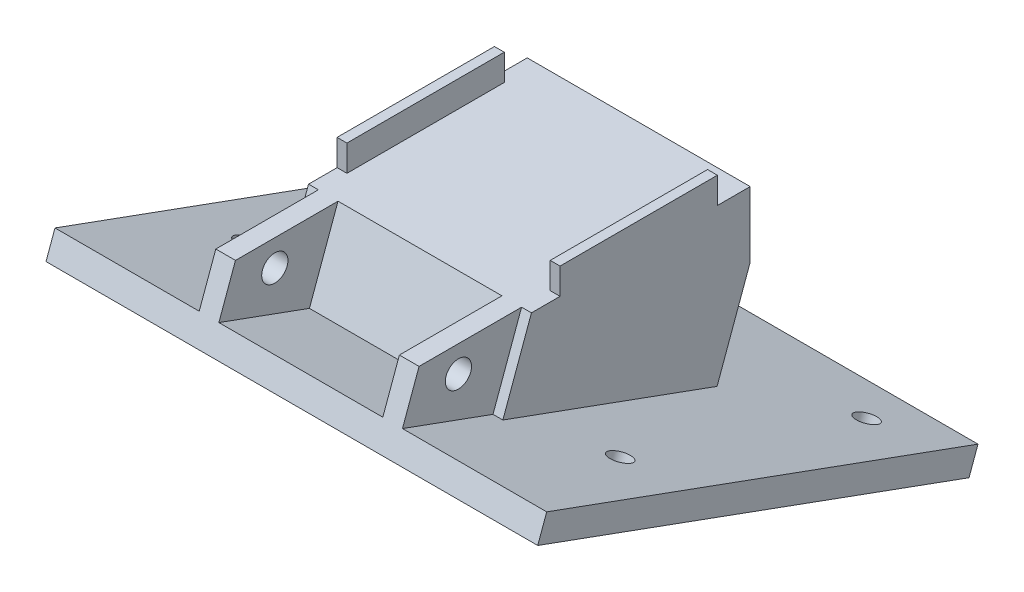
ISO-10303-21;
HEADER;
FILE_DESCRIPTION(('STEP AP214'),'2;1');
FILE_NAME('part.step','',(''),(''),'','','');
FILE_SCHEMA(('AUTOMOTIVE_DESIGN { 1 0 10303 214 1 1 1 1 }'));
ENDSEC;
DATA;
#1=APPLICATION_CONTEXT('core data for automotive mechanical design processes');
#2=APPLICATION_PROTOCOL_DEFINITION('international standard','automotive_design',2000,#1);
#3=PRODUCT_CONTEXT('',#1,'mechanical');
#4=PRODUCT('Part','Part','',(#3));
#5=PRODUCT_RELATED_PRODUCT_CATEGORY('part','',(#4));
#6=PRODUCT_DEFINITION_FORMATION('','',#4);
#7=PRODUCT_DEFINITION_CONTEXT('part definition',#1,'design');
#8=PRODUCT_DEFINITION('design','',#6,#7);
#9=PRODUCT_DEFINITION_SHAPE('','',#8);
#10=(LENGTH_UNIT() NAMED_UNIT(*) SI_UNIT(.MILLI.,.METRE.));
#11=(NAMED_UNIT(*) PLANE_ANGLE_UNIT() SI_UNIT($,.RADIAN.));
#12=(NAMED_UNIT(*) SI_UNIT($,.STERADIAN.) SOLID_ANGLE_UNIT());
#13=UNCERTAINTY_MEASURE_WITH_UNIT(LENGTH_MEASURE(1.E-05),#10,'distance_accuracy_value','');
#14=(GEOMETRIC_REPRESENTATION_CONTEXT(3) GLOBAL_UNCERTAINTY_ASSIGNED_CONTEXT((#13)) GLOBAL_UNIT_ASSIGNED_CONTEXT((#10,
#11,#12)) REPRESENTATION_CONTEXT('',''));
#15=CARTESIAN_POINT('',(0.,0.,0.));
#16=DIRECTION('',(0.,0.,1.));
#17=DIRECTION('',(1.,0.,0.));
#18=AXIS2_PLACEMENT_3D('',#15,#16,#17);
#19=CARTESIAN_POINT('',(-12.5,-28.1780056072107,24.5));
#20=DIRECTION('',(-1.,0.,0.));
#21=DIRECTION('',(0.,0.,1.));
#22=AXIS2_PLACEMENT_3D('',#19,#20,#21);
#23=PLANE('',#22);
#24=CARTESIAN_POINT('',(-12.5,6.,18.5));
#25=DIRECTION('',(-1.,0.,0.));
#26=DIRECTION('',(0.,0.,1.));
#27=AXIS2_PLACEMENT_3D('',#24,#25,#26);
#28=CIRCLE('',#27,2.);
#29=CARTESIAN_POINT('',(-12.5,6.,20.5));
#30=VERTEX_POINT('',#29);
#31=EDGE_CURVE('E308',#30,#30,#28,.T.);
#32=ORIENTED_EDGE('',*,*,#31,.T.);
#33=EDGE_LOOP('',(#32));
#34=FACE_BOUND('',#33,.T.);
#35=DIRECTION('',(0.,0.342020143325669,0.939692620785908));
#36=VECTOR('',#35,1.);
#37=CARTESIAN_POINT('',(-12.5,-1.41681525524397,14.7597232783522));
#38=LINE('',#37,#36);
#39=CARTESIAN_POINT('',(-12.5,-1.97734041654742,13.2196930546348));
#40=VERTEX_POINT('',#39);
#41=CARTESIAN_POINT('',(-12.5,3.04916302597692,27.0298977617813));
#42=VERTEX_POINT('',#41);
#43=EDGE_CURVE('E258',#40,#42,#38,.T.);
#44=ORIENTED_EDGE('',*,*,#43,.F.);
#45=DIRECTION('',(0.,-0.939692620785907,0.342020143325672));
#46=VECTOR('',#45,1.);
#47=CARTESIAN_POINT('',(-12.5,-3.85672565811916,13.9037333412861));
#48=LINE('',#47,#46);
#49=CARTESIAN_POINT('',(-12.5,10.,8.86029765733793));
#50=VERTEX_POINT('',#49);
#51=EDGE_CURVE('E270',#50,#40,#48,.T.);
#52=ORIENTED_EDGE('',*,*,#51,.F.);
#53=DIRECTION('',(0.,0.,1.));
#54=VECTOR('',#53,1.);
#55=CARTESIAN_POINT('',(-12.5,10.,24.5));
#56=LINE('',#55,#54);
#57=CARTESIAN_POINT('',(-12.5,10.,24.5));
#58=VERTEX_POINT('',#57);
#59=EDGE_CURVE('E311',#50,#58,#56,.T.);
#60=ORIENTED_EDGE('',*,*,#59,.T.);
#61=DIRECTION('',(0.,0.93969262078591,-0.342020143325663));
#62=VECTOR('',#61,1.);
#63=CARTESIAN_POINT('',(-12.5,10.,24.5));
#64=LINE('',#63,#62);
#65=EDGE_CURVE('E296',#42,#58,#64,.T.);
#66=ORIENTED_EDGE('',*,*,#65,.F.);
#67=EDGE_LOOP('',(#44,#52,#60,#66));
#68=FACE_BOUND('',#67,.T.);
#69=ADVANCED_FACE('F39',(#34,#68),#23,.F.);
#70=CARTESIAN_POINT('',(12.5,-28.1780056072107,24.5));
#71=DIRECTION('',(1.,0.,0.));
#72=DIRECTION('',(0.,0.,-1.));
#73=AXIS2_PLACEMENT_3D('',#70,#71,#72);
#74=PLANE('',#73);
#75=CARTESIAN_POINT('',(12.5,6.,18.5));
#76=DIRECTION('',(1.,0.,0.));
#77=DIRECTION('',(0.,0.,-1.));
#78=AXIS2_PLACEMENT_3D('',#75,#76,#77);
#79=CIRCLE('',#78,2.);
#80=CARTESIAN_POINT('',(12.5,6.,16.5));
#81=VERTEX_POINT('',#80);
#82=EDGE_CURVE('E305',#81,#81,#79,.T.);
#83=ORIENTED_EDGE('',*,*,#82,.T.);
#84=EDGE_LOOP('',(#83));
#85=FACE_BOUND('',#84,.T.);
#86=DIRECTION('',(0.,-0.342020143325669,-0.939692620785908));
#87=VECTOR('',#86,1.);
#88=CARTESIAN_POINT('',(12.5,-1.41681525524397,14.7597232783522));
#89=LINE('',#88,#87);
#90=CARTESIAN_POINT('',(12.5,3.04916302597692,27.0298977617813));
#91=VERTEX_POINT('',#90);
#92=CARTESIAN_POINT('',(12.5,-1.97734041654742,13.2196930546348));
#93=VERTEX_POINT('',#92);
#94=EDGE_CURVE('E256',#91,#93,#89,.T.);
#95=ORIENTED_EDGE('',*,*,#94,.F.);
#96=DIRECTION('',(0.,-0.93969262078591,0.342020143325663));
#97=VECTOR('',#96,1.);
#98=CARTESIAN_POINT('',(12.5,10.,24.5));
#99=LINE('',#98,#97);
#100=CARTESIAN_POINT('',(12.5,10.,24.5));
#101=VERTEX_POINT('',#100);
#102=EDGE_CURVE('E290',#101,#91,#99,.T.);
#103=ORIENTED_EDGE('',*,*,#102,.F.);
#104=DIRECTION('',(0.,0.,-1.));
#105=VECTOR('',#104,1.);
#106=CARTESIAN_POINT('',(12.5,10.,24.5));
#107=LINE('',#106,#105);
#108=CARTESIAN_POINT('',(12.5,10.,8.86029765733793));
#109=VERTEX_POINT('',#108);
#110=EDGE_CURVE('E318',#101,#109,#107,.T.);
#111=ORIENTED_EDGE('',*,*,#110,.T.);
#112=DIRECTION('',(0.,0.939692620785907,-0.342020143325672));
#113=VECTOR('',#112,1.);
#114=CARTESIAN_POINT('',(12.5,-3.85672565811916,13.9037333412861));
#115=LINE('',#114,#113);
#116=EDGE_CURVE('E286',#93,#109,#115,.T.);
#117=ORIENTED_EDGE('',*,*,#116,.F.);
#118=EDGE_LOOP('',(#95,#103,#111,#117));
#119=FACE_BOUND('',#118,.T.);
#120=ADVANCED_FACE('F522',(#85,#119),#74,.F.);
#121=CARTESIAN_POINT('',(-58.5072954458168,0.,12.5));
#122=DIRECTION('',(0.,0.342020143325672,0.939692620785907));
#123=DIRECTION('',(0.,-0.939692620785907,0.342020143325672));
#124=AXIS2_PLACEMENT_3D('',#121,#122,#123);
#125=PLANE('',#124);
#126=ORIENTED_EDGE('',*,*,#51,.T.);
#127=DIRECTION('',(1.,0.,0.));
#128=VECTOR('',#127,1.);
#129=CARTESIAN_POINT('',(-58.5072954458168,-1.97734041654742,13.2196930546348));
#130=LINE('',#129,#128);
#131=EDGE_CURVE('E253',#40,#93,#130,.T.);
#132=ORIENTED_EDGE('',*,*,#131,.T.);
#133=ORIENTED_EDGE('',*,*,#116,.T.);
#134=DIRECTION('',(-1.,0.,0.));
#135=VECTOR('',#134,1.);
#136=CARTESIAN_POINT('',(20.2179733245961,10.,8.86029765733793));
#137=LINE('',#136,#135);
#138=EDGE_CURVE('E260',#109,#50,#137,.T.);
#139=ORIENTED_EDGE('',*,*,#138,.T.);
#140=EDGE_LOOP('',(#126,#132,#133,#139));
#141=FACE_BOUND('',#140,.T.);
#142=ADVANCED_FACE('F529',(#141),#125,.T.);
#143=CARTESIAN_POINT('',(-17.,10.,24.5));
#144=DIRECTION('',(1.,0.,0.));
#145=DIRECTION('',(0.,0.,-1.));
#146=AXIS2_PLACEMENT_3D('',#143,#144,#145);
#147=PLANE('',#146);
#148=DIRECTION('',(0.,-0.342020143325669,-0.939692620785908));
#149=VECTOR('',#148,1.);
#150=CARTESIAN_POINT('',(-17.,3.04916302597693,27.0298977617814));
#151=LINE('',#150,#149);
#152=CARTESIAN_POINT('',(-17.,-1.97734041654742,13.2196930546348));
#153=VERTEX_POINT('',#152);
#154=CARTESIAN_POINT('',(-17.,-13.8689111957484,-19.4521291430663));
#155=VERTEX_POINT('',#154);
#156=EDGE_CURVE('E54',#153,#155,#151,.T.);
#157=ORIENTED_EDGE('',*,*,#156,.F.);
#158=DIRECTION('',(0.,0.939692620785907,-0.342020143325672));
#159=VECTOR('',#158,1.);
#160=CARTESIAN_POINT('',(-17.,0.,12.5));
#161=LINE('',#160,#159);
#162=CARTESIAN_POINT('',(-17.,10.,8.86029765733793));
#163=VERTEX_POINT('',#162);
#164=EDGE_CURVE('E279',#153,#163,#161,.T.);
#165=ORIENTED_EDGE('',*,*,#164,.T.);
#166=DIRECTION('',(0.,0.,1.));
#167=VECTOR('',#166,1.);
#168=CARTESIAN_POINT('',(-17.,10.,24.5));
#169=LINE('',#168,#167);
#170=CARTESIAN_POINT('',(-17.,10.,4.5));
#171=VERTEX_POINT('',#170);
#172=EDGE_CURVE('E380',#171,#163,#169,.T.);
#173=ORIENTED_EDGE('',*,*,#172,.F.);
#174=DIRECTION('',(0.,-1.,0.));
#175=VECTOR('',#174,1.);
#176=CARTESIAN_POINT('',(-17.,14.,4.5));
#177=LINE('',#176,#175);
#178=CARTESIAN_POINT('',(-17.,14.,4.5));
#179=VERTEX_POINT('',#178);
#180=EDGE_CURVE('E373',#179,#171,#177,.T.);
#181=ORIENTED_EDGE('',*,*,#180,.F.);
#182=DIRECTION('',(0.,0.,1.));
#183=VECTOR('',#182,1.);
#184=CARTESIAN_POINT('',(-17.,14.,-19.5));
#185=LINE('',#184,#183);
#186=CARTESIAN_POINT('',(-17.,14.,-19.5));
#187=VERTEX_POINT('',#186);
#188=EDGE_CURVE('E347',#187,#179,#185,.T.);
#189=ORIENTED_EDGE('',*,*,#188,.F.);
#190=DIRECTION('',(0.,-1.,0.));
#191=VECTOR('',#190,1.);
#192=CARTESIAN_POINT('',(-17.,14.,-19.5));
#193=LINE('',#192,#191);
#194=CARTESIAN_POINT('',(-17.,10.,-19.5));
#195=VERTEX_POINT('',#194);
#196=EDGE_CURVE('E357',#187,#195,#193,.T.);
#197=ORIENTED_EDGE('',*,*,#196,.T.);
#198=CARTESIAN_POINT('',(-17.,10.,-24.5));
#199=VERTEX_POINT('',#198);
#200=EDGE_CURVE('E377',#199,#195,#169,.T.);
#201=ORIENTED_EDGE('',*,*,#200,.F.);
#202=DIRECTION('',(0.,-1.,0.));
#203=VECTOR('',#202,1.);
#204=CARTESIAN_POINT('',(-17.,10.,-24.5));
#205=LINE('',#204,#203);
#206=CARTESIAN_POINT('',(-17.,0.,-24.5));
#207=VERTEX_POINT('',#206);
#208=EDGE_CURVE('E388',#199,#207,#205,.T.);
#209=ORIENTED_EDGE('',*,*,#208,.T.);
#210=DIRECTION('',(0.,-0.93969262078591,0.342020143325666));
#211=VECTOR('',#210,1.);
#212=CARTESIAN_POINT('',(-17.,-15.7482964373202,-18.768088856415));
#213=LINE('',#212,#211);
#214=EDGE_CURVE('E276',#207,#155,#213,.T.);
#215=ORIENTED_EDGE('',*,*,#214,.T.);
#216=EDGE_LOOP('',(#157,#165,#173,#181,#189,#197,#201,#209,#215));
#217=FACE_BOUND('',#216,.T.);
#218=ADVANCED_FACE('F41',(#217),#147,.F.);
#219=CARTESIAN_POINT('',(17.,10.,24.5));
#220=DIRECTION('',(-1.,0.,0.));
#221=DIRECTION('',(0.,0.,1.));
#222=AXIS2_PLACEMENT_3D('',#219,#220,#221);
#223=PLANE('',#222);
#224=DIRECTION('',(0.,0.342020143325669,0.939692620785908));
#225=VECTOR('',#224,1.);
#226=CARTESIAN_POINT('',(17.,3.04916302597693,27.0298977617814));
#227=LINE('',#226,#225);
#228=CARTESIAN_POINT('',(17.,-13.8689111957484,-19.4521291430663));
#229=VERTEX_POINT('',#228);
#230=CARTESIAN_POINT('',(17.,-1.97734041654742,13.2196930546348));
#231=VERTEX_POINT('',#230);
#232=EDGE_CURVE('E235',#229,#231,#227,.T.);
#233=ORIENTED_EDGE('',*,*,#232,.F.);
#234=DIRECTION('',(0.,0.939692620785909,-0.342020143325666));
#235=VECTOR('',#234,1.);
#236=CARTESIAN_POINT('',(17.,-15.7482964373202,-18.768088856415));
#237=LINE('',#236,#235);
#238=CARTESIAN_POINT('',(17.,0.,-24.5));
#239=VERTEX_POINT('',#238);
#240=EDGE_CURVE('E280',#229,#239,#237,.T.);
#241=ORIENTED_EDGE('',*,*,#240,.T.);
#242=DIRECTION('',(0.,-1.,0.));
#243=VECTOR('',#242,1.);
#244=CARTESIAN_POINT('',(17.,10.,-24.5));
#245=LINE('',#244,#243);
#246=CARTESIAN_POINT('',(17.,10.,-24.5));
#247=VERTEX_POINT('',#246);
#248=EDGE_CURVE('E47',#247,#239,#245,.T.);
#249=ORIENTED_EDGE('',*,*,#248,.F.);
#250=DIRECTION('',(0.,0.,-1.));
#251=VECTOR('',#250,1.);
#252=CARTESIAN_POINT('',(17.,10.,24.5));
#253=LINE('',#252,#251);
#254=CARTESIAN_POINT('',(17.,10.,-19.5));
#255=VERTEX_POINT('',#254);
#256=EDGE_CURVE('E386',#255,#247,#253,.T.);
#257=ORIENTED_EDGE('',*,*,#256,.F.);
#258=DIRECTION('',(0.,-1.,0.));
#259=VECTOR('',#258,1.);
#260=CARTESIAN_POINT('',(17.,14.,-19.5));
#261=LINE('',#260,#259);
#262=CARTESIAN_POINT('',(17.,14.,-19.5));
#263=VERTEX_POINT('',#262);
#264=EDGE_CURVE('E344',#263,#255,#261,.T.);
#265=ORIENTED_EDGE('',*,*,#264,.F.);
#266=DIRECTION('',(0.,0.,-1.));
#267=VECTOR('',#266,1.);
#268=CARTESIAN_POINT('',(17.,14.,-19.5));
#269=LINE('',#268,#267);
#270=CARTESIAN_POINT('',(17.,14.,4.5));
#271=VERTEX_POINT('',#270);
#272=EDGE_CURVE('E323',#271,#263,#269,.T.);
#273=ORIENTED_EDGE('',*,*,#272,.F.);
#274=DIRECTION('',(0.,-1.,0.));
#275=VECTOR('',#274,1.);
#276=CARTESIAN_POINT('',(17.,14.,4.5));
#277=LINE('',#276,#275);
#278=CARTESIAN_POINT('',(17.,10.,4.5));
#279=VERTEX_POINT('',#278);
#280=EDGE_CURVE('E333',#271,#279,#277,.T.);
#281=ORIENTED_EDGE('',*,*,#280,.T.);
#282=CARTESIAN_POINT('',(17.,10.,8.86029765733793));
#283=VERTEX_POINT('',#282);
#284=EDGE_CURVE('E383',#283,#279,#253,.T.);
#285=ORIENTED_EDGE('',*,*,#284,.F.);
#286=DIRECTION('',(0.,-0.939692620785907,0.342020143325672));
#287=VECTOR('',#286,1.);
#288=CARTESIAN_POINT('',(17.,0.,12.5));
#289=LINE('',#288,#287);
#290=EDGE_CURVE('E273',#283,#231,#289,.T.);
#291=ORIENTED_EDGE('',*,*,#290,.T.);
#292=EDGE_LOOP('',(#233,#241,#249,#257,#265,#273,#281,#285,#291));
#293=FACE_BOUND('',#292,.T.);
#294=ADVANCED_FACE('F402',(#293),#223,.F.);
#295=CARTESIAN_POINT('',(15.5,-28.1780056072107,24.5));
#296=DIRECTION('',(-1.,0.,0.));
#297=DIRECTION('',(0.,0.,1.));
#298=AXIS2_PLACEMENT_3D('',#295,#296,#297);
#299=PLANE('',#298);
#300=CARTESIAN_POINT('',(15.5,6.,18.5));
#301=DIRECTION('',(-1.,0.,0.));
#302=DIRECTION('',(0.,0.,1.));
#303=AXIS2_PLACEMENT_3D('',#300,#301,#302);
#304=CIRCLE('',#303,2.);
#305=CARTESIAN_POINT('',(15.5,6.,20.5));
#306=VERTEX_POINT('',#305);
#307=EDGE_CURVE('E302',#306,#306,#304,.F.);
#308=ORIENTED_EDGE('',*,*,#307,.F.);
#309=EDGE_LOOP('',(#308));
#310=FACE_BOUND('',#309,.T.);
#311=DIRECTION('',(0.,0.342020143325669,0.939692620785908));
#312=VECTOR('',#311,1.);
#313=CARTESIAN_POINT('',(15.5,-1.41681525524397,14.7597232783522));
#314=LINE('',#313,#312);
#315=CARTESIAN_POINT('',(15.5,-1.97734041654742,13.2196930546348));
#316=VERTEX_POINT('',#315);
#317=CARTESIAN_POINT('',(15.5,3.04916302597692,27.0298977617813));
#318=VERTEX_POINT('',#317);
#319=EDGE_CURVE('E251',#316,#318,#314,.T.);
#320=ORIENTED_EDGE('',*,*,#319,.F.);
#321=DIRECTION('',(0.,0.939692620785907,-0.342020143325672));
#322=VECTOR('',#321,1.);
#323=CARTESIAN_POINT('',(15.5,-3.85672565811916,13.9037333412861));
#324=LINE('',#323,#322);
#325=CARTESIAN_POINT('',(15.5,10.,8.86029765733793));
#326=VERTEX_POINT('',#325);
#327=EDGE_CURVE('E285',#316,#326,#324,.T.);
#328=ORIENTED_EDGE('',*,*,#327,.T.);
#329=DIRECTION('',(0.,0.,1.));
#330=VECTOR('',#329,1.);
#331=CARTESIAN_POINT('',(15.5,10.,24.5));
#332=LINE('',#331,#330);
#333=CARTESIAN_POINT('',(15.5,10.,24.5));
#334=VERTEX_POINT('',#333);
#335=EDGE_CURVE('E315',#326,#334,#332,.T.);
#336=ORIENTED_EDGE('',*,*,#335,.T.);
#337=DIRECTION('',(0.,-0.93969262078591,0.342020143325663));
#338=VECTOR('',#337,1.);
#339=CARTESIAN_POINT('',(15.5,10.,24.5));
#340=LINE('',#339,#338);
#341=EDGE_CURVE('E288',#334,#318,#340,.T.);
#342=ORIENTED_EDGE('',*,*,#341,.T.);
#343=EDGE_LOOP('',(#320,#328,#336,#342));
#344=FACE_BOUND('',#343,.T.);
#345=ADVANCED_FACE('F463',(#310,#344),#299,.F.);
#346=CARTESIAN_POINT('',(-15.5,-28.1780056072107,24.5));
#347=DIRECTION('',(1.,0.,0.));
#348=DIRECTION('',(0.,0.,-1.));
#349=AXIS2_PLACEMENT_3D('',#346,#347,#348);
#350=PLANE('',#349);
#351=CARTESIAN_POINT('',(-15.5,6.,18.5));
#352=DIRECTION('',(-1.,0.,0.));
#353=DIRECTION('',(0.,0.,1.));
#354=AXIS2_PLACEMENT_3D('',#351,#352,#353);
#355=CIRCLE('',#354,2.);
#356=CARTESIAN_POINT('',(-15.5,6.,20.5));
#357=VERTEX_POINT('',#356);
#358=EDGE_CURVE('E298',#357,#357,#355,.T.);
#359=ORIENTED_EDGE('',*,*,#358,.F.);
#360=EDGE_LOOP('',(#359));
#361=FACE_BOUND('',#360,.T.);
#362=DIRECTION('',(0.,-0.342020143325669,-0.939692620785908));
#363=VECTOR('',#362,1.);
#364=CARTESIAN_POINT('',(-15.5,-1.41681525524397,14.7597232783522));
#365=LINE('',#364,#363);
#366=CARTESIAN_POINT('',(-15.5,3.04916302597692,27.0298977617813));
#367=VERTEX_POINT('',#366);
#368=CARTESIAN_POINT('',(-15.5,-1.97734041654742,13.2196930546348));
#369=VERTEX_POINT('',#368);
#370=EDGE_CURVE('E249',#367,#369,#365,.T.);
#371=ORIENTED_EDGE('',*,*,#370,.F.);
#372=DIRECTION('',(0.,0.93969262078591,-0.342020143325663));
#373=VECTOR('',#372,1.);
#374=CARTESIAN_POINT('',(-15.5,10.,24.5));
#375=LINE('',#374,#373);
#376=CARTESIAN_POINT('',(-15.5,10.,24.5));
#377=VERTEX_POINT('',#376);
#378=EDGE_CURVE('E293',#367,#377,#375,.T.);
#379=ORIENTED_EDGE('',*,*,#378,.T.);
#380=DIRECTION('',(0.,0.,-1.));
#381=VECTOR('',#380,1.);
#382=CARTESIAN_POINT('',(-15.5,10.,24.5));
#383=LINE('',#382,#381);
#384=CARTESIAN_POINT('',(-15.5,10.,8.86029765733793));
#385=VERTEX_POINT('',#384);
#386=EDGE_CURVE('E312',#377,#385,#383,.T.);
#387=ORIENTED_EDGE('',*,*,#386,.T.);
#388=DIRECTION('',(0.,-0.939692620785907,0.342020143325672));
#389=VECTOR('',#388,1.);
#390=CARTESIAN_POINT('',(-15.5,-3.85672565811916,13.9037333412861));
#391=LINE('',#390,#389);
#392=EDGE_CURVE('E269',#385,#369,#391,.T.);
#393=ORIENTED_EDGE('',*,*,#392,.T.);
#394=EDGE_LOOP('',(#371,#379,#387,#393));
#395=FACE_BOUND('',#394,.T.);
#396=ADVANCED_FACE('F436',(#361,#395),#350,.F.);
#397=ORIENTED_EDGE('',*,*,#164,.F.);
#398=DIRECTION('',(1.,0.,0.));
#399=VECTOR('',#398,1.);
#400=CARTESIAN_POINT('',(-58.5072954458168,-1.97734041654742,13.2196930546348));
#401=LINE('',#400,#399);
#402=EDGE_CURVE('E246',#153,#369,#401,.T.);
#403=ORIENTED_EDGE('',*,*,#402,.T.);
#404=ORIENTED_EDGE('',*,*,#392,.F.);
#405=DIRECTION('',(-1.,0.,0.));
#406=VECTOR('',#405,1.);
#407=CARTESIAN_POINT('',(-4.85822227524087,10.,8.86029765733793));
#408=LINE('',#407,#406);
#409=EDGE_CURVE('E263',#385,#163,#408,.T.);
#410=ORIENTED_EDGE('',*,*,#409,.T.);
#411=EDGE_LOOP('',(#397,#403,#404,#410));
#412=FACE_BOUND('',#411,.T.);
#413=ADVANCED_FACE('F433',(#412),#125,.T.);
#414=ORIENTED_EDGE('',*,*,#327,.F.);
#415=DIRECTION('',(1.,0.,0.));
#416=VECTOR('',#415,1.);
#417=CARTESIAN_POINT('',(-58.5072954458168,-1.97734041654742,13.2196930546348));
#418=LINE('',#417,#416);
#419=EDGE_CURVE('E243',#316,#231,#418,.T.);
#420=ORIENTED_EDGE('',*,*,#419,.T.);
#421=ORIENTED_EDGE('',*,*,#290,.F.);
#422=DIRECTION('',(1.,0.,0.));
#423=VECTOR('',#422,1.);
#424=CARTESIAN_POINT('',(4.85822227524088,10.,8.86029765733793));
#425=LINE('',#424,#423);
#426=EDGE_CURVE('E266',#326,#283,#425,.T.);
#427=ORIENTED_EDGE('',*,*,#426,.F.);
#428=EDGE_LOOP('',(#414,#420,#421,#427));
#429=FACE_BOUND('',#428,.T.);
#430=ADVANCED_FACE('F459',(#429),#125,.T.);
#431=CARTESIAN_POINT('',(-58.5072954458168,-15.7482964373202,-18.768088856415));
#432=DIRECTION('',(0.,-0.342020143325666,-0.93969262078591));
#433=DIRECTION('',(0.,0.93969262078591,-0.342020143325666));
#434=AXIS2_PLACEMENT_3D('',#431,#432,#433);
#435=PLANE('',#434);
#436=ORIENTED_EDGE('',*,*,#240,.F.);
#437=DIRECTION('',(-1.,0.,0.));
#438=VECTOR('',#437,1.);
#439=CARTESIAN_POINT('',(-58.5072954458168,-13.8689111957484,-19.4521291430663));
#440=LINE('',#439,#438);
#441=EDGE_CURVE('E11',#229,#155,#440,.T.);
#442=ORIENTED_EDGE('',*,*,#441,.T.);
#443=ORIENTED_EDGE('',*,*,#214,.F.);
#444=DIRECTION('',(-1.,0.,0.));
#445=VECTOR('',#444,1.);
#446=CARTESIAN_POINT('',(17.,0.,-24.5));
#447=LINE('',#446,#445);
#448=EDGE_CURVE('E376',#239,#207,#447,.T.);
#449=ORIENTED_EDGE('',*,*,#448,.F.);
#450=EDGE_LOOP('',(#436,#442,#443,#449));
#451=FACE_BOUND('',#450,.T.);
#452=ADVANCED_FACE('F406',(#451),#435,.T.);
#453=CARTESIAN_POINT('',(0.,10.,0.));
#454=DIRECTION('',(0.,1.,0.));
#455=DIRECTION('',(0.,0.,1.));
#456=AXIS2_PLACEMENT_3D('',#453,#454,#455);
#457=PLANE('',#456);
#458=ORIENTED_EDGE('',*,*,#59,.F.);
#459=ORIENTED_EDGE('',*,*,#138,.F.);
#460=ORIENTED_EDGE('',*,*,#110,.F.);
#461=DIRECTION('',(1.,0.,0.));
#462=VECTOR('',#461,1.);
#463=CARTESIAN_POINT('',(17.,10.,24.5));
#464=LINE('',#463,#462);
#465=EDGE_CURVE('E379',#101,#334,#464,.T.);
#466=ORIENTED_EDGE('',*,*,#465,.T.);
#467=ORIENTED_EDGE('',*,*,#335,.F.);
#468=ORIENTED_EDGE('',*,*,#426,.T.);
#469=ORIENTED_EDGE('',*,*,#284,.T.);
#470=DIRECTION('',(1.,0.,0.));
#471=VECTOR('',#470,1.);
#472=CARTESIAN_POINT('',(17.,10.,4.5));
#473=LINE('',#472,#471);
#474=CARTESIAN_POINT('',(15.5,10.,4.5));
#475=VERTEX_POINT('',#474);
#476=EDGE_CURVE('E327',#475,#279,#473,.T.);
#477=ORIENTED_EDGE('',*,*,#476,.F.);
#478=DIRECTION('',(0.,0.,1.));
#479=VECTOR('',#478,1.);
#480=CARTESIAN_POINT('',(15.5,10.,-19.5));
#481=LINE('',#480,#479);
#482=CARTESIAN_POINT('',(15.5,10.,-19.5));
#483=VERTEX_POINT('',#482);
#484=EDGE_CURVE('E335',#483,#475,#481,.T.);
#485=ORIENTED_EDGE('',*,*,#484,.F.);
#486=DIRECTION('',(-1.,0.,0.));
#487=VECTOR('',#486,1.);
#488=CARTESIAN_POINT('',(17.,10.,-19.5));
#489=LINE('',#488,#487);
#490=EDGE_CURVE('E314',#255,#483,#489,.T.);
#491=ORIENTED_EDGE('',*,*,#490,.F.);
#492=ORIENTED_EDGE('',*,*,#256,.T.);
#493=DIRECTION('',(-1.,0.,0.));
#494=VECTOR('',#493,1.);
#495=CARTESIAN_POINT('',(17.,10.,-24.5));
#496=LINE('',#495,#494);
#497=EDGE_CURVE('E385',#247,#199,#496,.T.);
#498=ORIENTED_EDGE('',*,*,#497,.T.);
#499=ORIENTED_EDGE('',*,*,#200,.T.);
#500=DIRECTION('',(-1.,0.,0.));
#501=VECTOR('',#500,1.);
#502=CARTESIAN_POINT('',(-17.,10.,-19.5));
#503=LINE('',#502,#501);
#504=CARTESIAN_POINT('',(-15.5,10.,-19.5));
#505=VERTEX_POINT('',#504);
#506=EDGE_CURVE('E351',#505,#195,#503,.T.);
#507=ORIENTED_EDGE('',*,*,#506,.F.);
#508=DIRECTION('',(0.,0.,-1.));
#509=VECTOR('',#508,1.);
#510=CARTESIAN_POINT('',(-15.5,10.,-19.5));
#511=LINE('',#510,#509);
#512=CARTESIAN_POINT('',(-15.5,10.,4.5));
#513=VERTEX_POINT('',#512);
#514=EDGE_CURVE('E360',#513,#505,#511,.T.);
#515=ORIENTED_EDGE('',*,*,#514,.F.);
#516=DIRECTION('',(1.,0.,0.));
#517=VECTOR('',#516,1.);
#518=CARTESIAN_POINT('',(-17.,10.,4.5));
#519=LINE('',#518,#517);
#520=EDGE_CURVE('E346',#171,#513,#519,.T.);
#521=ORIENTED_EDGE('',*,*,#520,.F.);
#522=ORIENTED_EDGE('',*,*,#172,.T.);
#523=ORIENTED_EDGE('',*,*,#409,.F.);
#524=ORIENTED_EDGE('',*,*,#386,.F.);
#525=EDGE_CURVE('E382',#377,#58,#464,.T.);
#526=ORIENTED_EDGE('',*,*,#525,.T.);
#527=EDGE_LOOP('',(#458,#459,#460,#466,#467,#468,#469,#477,#485,#491,#492,#498,#499,#507,#515,
#521,#522,#523,#524,#526));
#528=FACE_BOUND('',#527,.T.);
#529=ADVANCED_FACE('F414',(#528),#457,.T.);
#530=CARTESIAN_POINT('',(17.,10.,-24.5));
#531=DIRECTION('',(0.,0.,1.));
#532=DIRECTION('',(1.,0.,0.));
#533=AXIS2_PLACEMENT_3D('',#530,#531,#532);
#534=PLANE('',#533);
#535=ORIENTED_EDGE('',*,*,#448,.T.);
#536=ORIENTED_EDGE('',*,*,#208,.F.);
#537=ORIENTED_EDGE('',*,*,#497,.F.);
#538=ORIENTED_EDGE('',*,*,#248,.T.);
#539=EDGE_LOOP('',(#535,#536,#537,#538));
#540=FACE_BOUND('',#539,.T.);
#541=ADVANCED_FACE('F396',(#540),#534,.F.);
#542=CARTESIAN_POINT('',(-17.,14.,4.5));
#543=DIRECTION('',(0.,0.,-1.));
#544=DIRECTION('',(-1.,0.,0.));
#545=AXIS2_PLACEMENT_3D('',#542,#543,#544);
#546=PLANE('',#545);
#547=ORIENTED_EDGE('',*,*,#520,.T.);
#548=DIRECTION('',(0.,-1.,0.));
#549=VECTOR('',#548,1.);
#550=CARTESIAN_POINT('',(-15.5,14.,4.5));
#551=LINE('',#550,#549);
#552=CARTESIAN_POINT('',(-15.5,14.,4.5));
#553=VERTEX_POINT('',#552);
#554=EDGE_CURVE('E370',#553,#513,#551,.T.);
#555=ORIENTED_EDGE('',*,*,#554,.F.);
#556=DIRECTION('',(1.,0.,0.));
#557=VECTOR('',#556,1.);
#558=CARTESIAN_POINT('',(-17.,14.,4.5));
#559=LINE('',#558,#557);
#560=EDGE_CURVE('E350',#179,#553,#559,.T.);
#561=ORIENTED_EDGE('',*,*,#560,.F.);
#562=ORIENTED_EDGE('',*,*,#180,.T.);
#563=EDGE_LOOP('',(#547,#555,#561,#562));
#564=FACE_BOUND('',#563,.T.);
#565=ADVANCED_FACE('F426',(#564),#546,.F.);
#566=CARTESIAN_POINT('',(-15.5,14.,-19.5));
#567=DIRECTION('',(-1.,0.,0.));
#568=DIRECTION('',(0.,0.,1.));
#569=AXIS2_PLACEMENT_3D('',#566,#567,#568);
#570=PLANE('',#569);
#571=ORIENTED_EDGE('',*,*,#514,.T.);
#572=DIRECTION('',(0.,-1.,0.));
#573=VECTOR('',#572,1.);
#574=CARTESIAN_POINT('',(-15.5,14.,-19.5));
#575=LINE('',#574,#573);
#576=CARTESIAN_POINT('',(-15.5,14.,-19.5));
#577=VERTEX_POINT('',#576);
#578=EDGE_CURVE('E367',#577,#505,#575,.T.);
#579=ORIENTED_EDGE('',*,*,#578,.F.);
#580=DIRECTION('',(0.,0.,-1.));
#581=VECTOR('',#580,1.);
#582=CARTESIAN_POINT('',(-15.5,14.,-19.5));
#583=LINE('',#582,#581);
#584=EDGE_CURVE('E353',#553,#577,#583,.T.);
#585=ORIENTED_EDGE('',*,*,#584,.F.);
#586=ORIENTED_EDGE('',*,*,#554,.T.);
#587=EDGE_LOOP('',(#571,#579,#585,#586));
#588=FACE_BOUND('',#587,.T.);
#589=ADVANCED_FACE('F421',(#588),#570,.F.);
#590=CARTESIAN_POINT('',(-17.,14.,-19.5));
#591=DIRECTION('',(0.,0.,1.));
#592=DIRECTION('',(1.,0.,0.));
#593=AXIS2_PLACEMENT_3D('',#590,#591,#592);
#594=PLANE('',#593);
#595=ORIENTED_EDGE('',*,*,#506,.T.);
#596=ORIENTED_EDGE('',*,*,#196,.F.);
#597=DIRECTION('',(-1.,0.,0.));
#598=VECTOR('',#597,1.);
#599=CARTESIAN_POINT('',(-17.,14.,-19.5));
#600=LINE('',#599,#598);
#601=EDGE_CURVE('E355',#577,#187,#600,.T.);
#602=ORIENTED_EDGE('',*,*,#601,.F.);
#603=ORIENTED_EDGE('',*,*,#578,.T.);
#604=EDGE_LOOP('',(#595,#596,#602,#603));
#605=FACE_BOUND('',#604,.T.);
#606=ADVANCED_FACE('F416',(#605),#594,.F.);
#607=CARTESIAN_POINT('',(0.,14.,0.));
#608=DIRECTION('',(0.,1.,0.));
#609=DIRECTION('',(0.,0.,1.));
#610=AXIS2_PLACEMENT_3D('',#607,#608,#609);
#611=PLANE('',#610);
#612=ORIENTED_EDGE('',*,*,#188,.T.);
#613=ORIENTED_EDGE('',*,*,#560,.T.);
#614=ORIENTED_EDGE('',*,*,#584,.T.);
#615=ORIENTED_EDGE('',*,*,#601,.T.);
#616=EDGE_LOOP('',(#612,#613,#614,#615));
#617=FACE_BOUND('',#616,.T.);
#618=ADVANCED_FACE('F544',(#617),#611,.T.);
#619=CARTESIAN_POINT('',(17.,14.,-19.5));
#620=DIRECTION('',(0.,0.,1.));
#621=DIRECTION('',(1.,0.,0.));
#622=AXIS2_PLACEMENT_3D('',#619,#620,#621);
#623=PLANE('',#622);
#624=ORIENTED_EDGE('',*,*,#490,.T.);
#625=DIRECTION('',(0.,-1.,0.));
#626=VECTOR('',#625,1.);
#627=CARTESIAN_POINT('',(15.5,14.,-19.5));
#628=LINE('',#627,#626);
#629=CARTESIAN_POINT('',(15.5,14.,-19.5));
#630=VERTEX_POINT('',#629);
#631=EDGE_CURVE('E341',#630,#483,#628,.T.);
#632=ORIENTED_EDGE('',*,*,#631,.F.);
#633=DIRECTION('',(-1.,0.,0.));
#634=VECTOR('',#633,1.);
#635=CARTESIAN_POINT('',(17.,14.,-19.5));
#636=LINE('',#635,#634);
#637=EDGE_CURVE('E326',#263,#630,#636,.T.);
#638=ORIENTED_EDGE('',*,*,#637,.F.);
#639=ORIENTED_EDGE('',*,*,#264,.T.);
#640=EDGE_LOOP('',(#624,#632,#638,#639));
#641=FACE_BOUND('',#640,.T.);
#642=ADVANCED_FACE('F445',(#641),#623,.F.);
#643=CARTESIAN_POINT('',(15.5,14.,-19.5));
#644=DIRECTION('',(1.,0.,0.));
#645=DIRECTION('',(0.,0.,-1.));
#646=AXIS2_PLACEMENT_3D('',#643,#644,#645);
#647=PLANE('',#646);
#648=ORIENTED_EDGE('',*,*,#484,.T.);
#649=DIRECTION('',(0.,-1.,0.));
#650=VECTOR('',#649,1.);
#651=CARTESIAN_POINT('',(15.5,14.,4.5));
#652=LINE('',#651,#650);
#653=CARTESIAN_POINT('',(15.5,14.,4.5));
#654=VERTEX_POINT('',#653);
#655=EDGE_CURVE('E61',#654,#475,#652,.T.);
#656=ORIENTED_EDGE('',*,*,#655,.F.);
#657=DIRECTION('',(0.,0.,1.));
#658=VECTOR('',#657,1.);
#659=CARTESIAN_POINT('',(15.5,14.,-19.5));
#660=LINE('',#659,#658);
#661=EDGE_CURVE('E329',#630,#654,#660,.T.);
#662=ORIENTED_EDGE('',*,*,#661,.F.);
#663=ORIENTED_EDGE('',*,*,#631,.T.);
#664=EDGE_LOOP('',(#648,#656,#662,#663));
#665=FACE_BOUND('',#664,.T.);
#666=ADVANCED_FACE('F448',(#665),#647,.F.);
#667=CARTESIAN_POINT('',(17.,14.,4.5));
#668=DIRECTION('',(0.,0.,-1.));
#669=DIRECTION('',(-1.,0.,0.));
#670=AXIS2_PLACEMENT_3D('',#667,#668,#669);
#671=PLANE('',#670);
#672=ORIENTED_EDGE('',*,*,#476,.T.);
#673=ORIENTED_EDGE('',*,*,#280,.F.);
#674=DIRECTION('',(1.,0.,0.));
#675=VECTOR('',#674,1.);
#676=CARTESIAN_POINT('',(17.,14.,4.5));
#677=LINE('',#676,#675);
#678=EDGE_CURVE('E331',#654,#271,#677,.T.);
#679=ORIENTED_EDGE('',*,*,#678,.F.);
#680=ORIENTED_EDGE('',*,*,#655,.T.);
#681=EDGE_LOOP('',(#672,#673,#679,#680));
#682=FACE_BOUND('',#681,.T.);
#683=ADVANCED_FACE('F454',(#682),#671,.F.);
#684=CARTESIAN_POINT('',(0.,14.,0.));
#685=DIRECTION('',(0.,-1.,0.));
#686=DIRECTION('',(0.,0.,-1.));
#687=AXIS2_PLACEMENT_3D('',#684,#685,#686);
#688=PLANE('',#687);
#689=ORIENTED_EDGE('',*,*,#272,.T.);
#690=ORIENTED_EDGE('',*,*,#637,.T.);
#691=ORIENTED_EDGE('',*,*,#661,.T.);
#692=ORIENTED_EDGE('',*,*,#678,.T.);
#693=EDGE_LOOP('',(#689,#690,#691,#692));
#694=FACE_BOUND('',#693,.T.);
#695=ADVANCED_FACE('F450',(#694),#688,.F.);
#696=CARTESIAN_POINT('',(21.1568542494924,6.,18.5));
#697=DIRECTION('',(-1.,0.,0.));
#698=DIRECTION('',(0.,0.,1.));
#699=AXIS2_PLACEMENT_3D('',#696,#697,#698);
#700=CYLINDRICAL_SURFACE('',#699,2.);
#701=ORIENTED_EDGE('',*,*,#358,.T.);
#702=EDGE_LOOP('',(#701));
#703=FACE_BOUND('',#702,.T.);
#704=ORIENTED_EDGE('',*,*,#31,.F.);
#705=EDGE_LOOP('',(#704));
#706=FACE_BOUND('',#705,.T.);
#707=ADVANCED_FACE('F537',(#703,#706),#700,.F.);
#708=ORIENTED_EDGE('',*,*,#307,.T.);
#709=EDGE_LOOP('',(#708));
#710=FACE_BOUND('',#709,.T.);
#711=ORIENTED_EDGE('',*,*,#82,.F.);
#712=EDGE_LOOP('',(#711));
#713=FACE_BOUND('',#712,.T.);
#714=ADVANCED_FACE('F594',(#710,#713),#700,.F.);
#715=CARTESIAN_POINT('',(-12.5,10.,24.5));
#716=DIRECTION('',(0.,0.342020143325663,0.93969262078591));
#717=DIRECTION('',(0.,-0.939692620785911,0.342020143325663));
#718=AXIS2_PLACEMENT_3D('',#715,#716,#717);
#719=PLANE('',#718);
#720=DIRECTION('',(-1.,0.,0.));
#721=VECTOR('',#720,1.);
#722=CARTESIAN_POINT('',(-37.5,3.04916302597692,27.0298977617813));
#723=LINE('',#722,#721);
#724=EDGE_CURVE('E469',#91,#42,#723,.T.);
#725=ORIENTED_EDGE('',*,*,#724,.T.);
#726=ORIENTED_EDGE('',*,*,#65,.T.);
#727=ORIENTED_EDGE('',*,*,#525,.F.);
#728=ORIENTED_EDGE('',*,*,#378,.F.);
#729=CARTESIAN_POINT('',(-37.5,3.04916302597692,27.0298977617813));
#730=VERTEX_POINT('',#729);
#731=EDGE_CURVE('E471',#367,#730,#723,.T.);
#732=ORIENTED_EDGE('',*,*,#731,.T.);
#733=DIRECTION('',(0.,0.939692620785908,-0.342020143325669));
#734=VECTOR('',#733,1.);
#735=CARTESIAN_POINT('',(-37.5,-0.709607457166714,28.397978335084));
#736=LINE('',#735,#734);
#737=CARTESIAN_POINT('',(-37.5,-0.709607457166714,28.397978335084));
#738=VERTEX_POINT('',#737);
#739=EDGE_CURVE('E216',#738,#730,#736,.T.);
#740=ORIENTED_EDGE('',*,*,#739,.F.);
#741=DIRECTION('',(-1.,0.,0.));
#742=VECTOR('',#741,1.);
#743=CARTESIAN_POINT('',(-37.5,-0.709607457166714,28.397978335084));
#744=LINE('',#743,#742);
#745=CARTESIAN_POINT('',(37.5,-0.709607457166714,28.397978335084));
#746=VERTEX_POINT('',#745);
#747=EDGE_CURVE('E207',#746,#738,#744,.T.);
#748=ORIENTED_EDGE('',*,*,#747,.F.);
#749=DIRECTION('',(0.,0.939692620785908,-0.342020143325669));
#750=VECTOR('',#749,1.);
#751=CARTESIAN_POINT('',(37.5,-0.709607457166714,28.397978335084));
#752=LINE('',#751,#750);
#753=CARTESIAN_POINT('',(37.5,3.04916302597692,27.0298977617813));
#754=VERTEX_POINT('',#753);
#755=EDGE_CURVE('E213',#746,#754,#752,.T.);
#756=ORIENTED_EDGE('',*,*,#755,.T.);
#757=EDGE_CURVE('E467',#754,#318,#723,.T.);
#758=ORIENTED_EDGE('',*,*,#757,.T.);
#759=ORIENTED_EDGE('',*,*,#341,.F.);
#760=ORIENTED_EDGE('',*,*,#465,.F.);
#761=ORIENTED_EDGE('',*,*,#102,.T.);
#762=EDGE_LOOP('',(#725,#726,#727,#728,#732,#740,#748,#756,#758,#759,#760,#761));
#763=FACE_BOUND('',#762,.T.);
#764=ADVANCED_FACE('F210',(#763),#719,.T.);
#765=CARTESIAN_POINT('',(0.,-5.9947629770883,2.18191528514119));
#766=DIRECTION('',(0.,-0.939692620785908,0.342020143325669));
#767=DIRECTION('',(0.,-0.342020143325669,-0.939692620785908));
#768=AXIS2_PLACEMENT_3D('',#765,#766,#767);
#769=PLANE('',#768);
#770=ORIENTED_EDGE('',*,*,#131,.F.);
#771=ORIENTED_EDGE('',*,*,#43,.T.);
#772=ORIENTED_EDGE('',*,*,#724,.F.);
#773=ORIENTED_EDGE('',*,*,#94,.T.);
#774=EDGE_LOOP('',(#770,#771,#772,#773));
#775=FACE_BOUND('',#774,.T.);
#776=ADVANCED_FACE('F515',(#775),#769,.F.);
#777=CARTESIAN_POINT('',(28.5,-17.9850757885518,-30.761198416552));
#778=DIRECTION('',(0.,-0.939692620785908,0.342020143325669));
#779=DIRECTION('',(0.,-0.342020143325669,-0.939692620785908));
#780=AXIS2_PLACEMENT_3D('',#777,#778,#779);
#781=CIRCLE('',#780,1.65);
#782=CARTESIAN_POINT('',(28.5,-18.5494090250391,-32.3116912408488));
#783=VERTEX_POINT('',#782);
#784=EDGE_CURVE('E476',#783,#783,#781,.T.);
#785=ORIENTED_EDGE('',*,*,#784,.T.);
#786=EDGE_LOOP('',(#785));
#787=FACE_BOUND('',#786,.T.);
#788=CARTESIAN_POINT('',(28.5,-4.30427005552497,6.8265064148843));
#789=DIRECTION('',(0.,-0.939692620785908,0.342020143325669));
#790=DIRECTION('',(0.,-0.342020143325669,-0.939692620785908));
#791=AXIS2_PLACEMENT_3D('',#788,#789,#790);
#792=CIRCLE('',#791,1.65);
#793=CARTESIAN_POINT('',(28.5,-4.86860329201233,5.27601359058756));
#794=VERTEX_POINT('',#793);
#795=EDGE_CURVE('E485',#794,#794,#792,.T.);
#796=ORIENTED_EDGE('',*,*,#795,.T.);
#797=EDGE_LOOP('',(#796));
#798=FACE_BOUND('',#797,.T.);
#799=CARTESIAN_POINT('',(-28.5,-4.30427005552497,6.8265064148843));
#800=DIRECTION('',(0.,-0.939692620785908,0.342020143325669));
#801=DIRECTION('',(0.,-0.342020143325669,-0.939692620785908));
#802=AXIS2_PLACEMENT_3D('',#799,#800,#801);
#803=CIRCLE('',#802,1.65);
#804=CARTESIAN_POINT('',(-28.5,-4.86860329201233,5.27601359058756));
#805=VERTEX_POINT('',#804);
#806=EDGE_CURVE('E491',#805,#805,#803,.T.);
#807=ORIENTED_EDGE('',*,*,#806,.T.);
#808=EDGE_LOOP('',(#807));
#809=FACE_BOUND('',#808,.T.);
#810=CARTESIAN_POINT('',(-28.5,-17.9850757885518,-30.761198416552));
#811=DIRECTION('',(0.,-0.939692620785908,0.342020143325669));
#812=DIRECTION('',(0.,-0.342020143325669,-0.939692620785908));
#813=AXIS2_PLACEMENT_3D('',#810,#811,#812);
#814=CIRCLE('',#813,1.65);
#815=CARTESIAN_POINT('',(-28.5,-18.5494090250391,-32.3116912408488));
#816=VERTEX_POINT('',#815);
#817=EDGE_CURVE('E497',#816,#816,#814,.T.);
#818=ORIENTED_EDGE('',*,*,#817,.T.);
#819=EDGE_LOOP('',(#818));
#820=FACE_BOUND('',#819,.T.);
#821=ORIENTED_EDGE('',*,*,#419,.F.);
#822=ORIENTED_EDGE('',*,*,#319,.T.);
#823=ORIENTED_EDGE('',*,*,#757,.F.);
#824=DIRECTION('',(0.,0.342020143325669,0.939692620785908));
#825=VECTOR('',#824,1.);
#826=CARTESIAN_POINT('',(37.5,3.04916302597692,27.0298977617813));
#827=LINE('',#826,#825);
#828=CARTESIAN_POINT('',(37.5,-20.8922470068199,-38.7485856932322));
#829=VERTEX_POINT('',#828);
#830=EDGE_CURVE('E234',#829,#754,#827,.T.);
#831=ORIENTED_EDGE('',*,*,#830,.F.);
#832=DIRECTION('',(1.,0.,0.));
#833=VECTOR('',#832,1.);
#834=CARTESIAN_POINT('',(-37.5,-20.8922470068199,-38.7485856932322));
#835=LINE('',#834,#833);
#836=CARTESIAN_POINT('',(-37.5,-20.8922470068199,-38.7485856932322));
#837=VERTEX_POINT('',#836);
#838=EDGE_CURVE('E230',#837,#829,#835,.T.);
#839=ORIENTED_EDGE('',*,*,#838,.F.);
#840=DIRECTION('',(0.,-0.342020143325669,-0.939692620785908));
#841=VECTOR('',#840,1.);
#842=CARTESIAN_POINT('',(-37.5,3.04916302597692,27.0298977617813));
#843=LINE('',#842,#841);
#844=EDGE_CURVE('E468',#730,#837,#843,.T.);
#845=ORIENTED_EDGE('',*,*,#844,.F.);
#846=ORIENTED_EDGE('',*,*,#731,.F.);
#847=ORIENTED_EDGE('',*,*,#370,.T.);
#848=ORIENTED_EDGE('',*,*,#402,.F.);
#849=ORIENTED_EDGE('',*,*,#156,.T.);
#850=ORIENTED_EDGE('',*,*,#441,.F.);
#851=ORIENTED_EDGE('',*,*,#232,.T.);
#852=EDGE_LOOP('',(#821,#822,#823,#831,#839,#845,#846,#847,#848,#849,#850,#851));
#853=FACE_BOUND('',#852,.T.);
#854=ADVANCED_FACE('F461',(#787,#798,#809,#820,#853),#769,.F.);
#855=CARTESIAN_POINT('',(0.,-9.75353346023194,3.54999585844387));
#856=DIRECTION('',(0.,-0.939692620785908,0.342020143325669));
#857=DIRECTION('',(0.,-0.342020143325669,-0.939692620785908));
#858=AXIS2_PLACEMENT_3D('',#855,#856,#857);
#859=PLANE('',#858);
#860=CARTESIAN_POINT('',(-28.5,-8.06304053866861,8.19458698818698));
#861=DIRECTION('',(0.,-0.939692620785908,0.342020143325669));
#862=DIRECTION('',(0.,-0.342020143325669,-0.939692620785908));
#863=AXIS2_PLACEMENT_3D('',#860,#861,#862);
#864=CIRCLE('',#863,1.65);
#865=CARTESIAN_POINT('',(-28.5,-8.62737377515596,6.64409416389024));
#866=VERTEX_POINT('',#865);
#867=EDGE_CURVE('E488',#866,#866,#864,.T.);
#868=ORIENTED_EDGE('',*,*,#867,.F.);
#869=EDGE_LOOP('',(#868));
#870=FACE_BOUND('',#869,.T.);
#871=CARTESIAN_POINT('',(28.5,-21.7438462716954,-29.3931178432493));
#872=DIRECTION('',(0.,-0.939692620785908,0.342020143325669));
#873=DIRECTION('',(0.,-0.342020143325669,-0.939692620785908));
#874=AXIS2_PLACEMENT_3D('',#871,#872,#873);
#875=CIRCLE('',#874,1.65);
#876=CARTESIAN_POINT('',(28.5,-22.3081795081827,-30.9436106675461));
#877=VERTEX_POINT('',#876);
#878=EDGE_CURVE('E474',#877,#877,#875,.T.);
#879=ORIENTED_EDGE('',*,*,#878,.F.);
#880=EDGE_LOOP('',(#879));
#881=FACE_BOUND('',#880,.T.);
#882=DIRECTION('',(0.,0.342020143325669,0.939692620785908));
#883=VECTOR('',#882,1.);
#884=CARTESIAN_POINT('',(37.5,-0.709607457166714,28.397978335084));
#885=LINE('',#884,#883);
#886=CARTESIAN_POINT('',(37.5,-24.6510174899636,-37.3805051199296));
#887=VERTEX_POINT('',#886);
#888=EDGE_CURVE('E220',#887,#746,#885,.T.);
#889=ORIENTED_EDGE('',*,*,#888,.T.);
#890=ORIENTED_EDGE('',*,*,#747,.T.);
#891=DIRECTION('',(0.,-0.342020143325669,-0.939692620785908));
#892=VECTOR('',#891,1.);
#893=CARTESIAN_POINT('',(-37.5,-0.709607457166714,28.397978335084));
#894=LINE('',#893,#892);
#895=CARTESIAN_POINT('',(-37.5,-24.6510174899636,-37.3805051199296));
#896=VERTEX_POINT('',#895);
#897=EDGE_CURVE('E219',#738,#896,#894,.T.);
#898=ORIENTED_EDGE('',*,*,#897,.T.);
#899=DIRECTION('',(1.,0.,0.));
#900=VECTOR('',#899,1.);
#901=CARTESIAN_POINT('',(-37.5,-24.6510174899636,-37.3805051199296));
#902=LINE('',#901,#900);
#903=EDGE_CURVE('E226',#896,#887,#902,.T.);
#904=ORIENTED_EDGE('',*,*,#903,.T.);
#905=EDGE_LOOP('',(#889,#890,#898,#904));
#906=FACE_BOUND('',#905,.T.);
#907=CARTESIAN_POINT('',(28.5,-8.06304053866861,8.19458698818698));
#908=DIRECTION('',(0.,-0.939692620785908,0.342020143325669));
#909=DIRECTION('',(0.,-0.342020143325669,-0.939692620785908));
#910=AXIS2_PLACEMENT_3D('',#907,#908,#909);
#911=CIRCLE('',#910,1.65);
#912=CARTESIAN_POINT('',(28.5,-8.62737377515596,6.64409416389024));
#913=VERTEX_POINT('',#912);
#914=EDGE_CURVE('E483',#913,#913,#911,.T.);
#915=ORIENTED_EDGE('',*,*,#914,.F.);
#916=EDGE_LOOP('',(#915));
#917=FACE_BOUND('',#916,.T.);
#918=CARTESIAN_POINT('',(-28.5,-21.7438462716954,-29.3931178432493));
#919=DIRECTION('',(0.,-0.939692620785908,0.342020143325669));
#920=DIRECTION('',(0.,-0.342020143325669,-0.939692620785908));
#921=AXIS2_PLACEMENT_3D('',#918,#919,#920);
#922=CIRCLE('',#921,1.65);
#923=CARTESIAN_POINT('',(-28.5,-22.3081795081827,-30.9436106675461));
#924=VERTEX_POINT('',#923);
#925=EDGE_CURVE('E494',#924,#924,#922,.T.);
#926=ORIENTED_EDGE('',*,*,#925,.F.);
#927=EDGE_LOOP('',(#926));
#928=FACE_BOUND('',#927,.T.);
#929=ADVANCED_FACE('F223',(#870,#881,#906,#917,#928),#859,.T.);
#930=CARTESIAN_POINT('',(37.5,-0.709607457166714,28.397978335084));
#931=DIRECTION('',(-1.,0.,0.));
#932=DIRECTION('',(0.,0.,1.));
#933=AXIS2_PLACEMENT_3D('',#930,#931,#932);
#934=PLANE('',#933);
#935=ORIENTED_EDGE('',*,*,#830,.T.);
#936=ORIENTED_EDGE('',*,*,#755,.F.);
#937=ORIENTED_EDGE('',*,*,#888,.F.);
#938=DIRECTION('',(0.,0.939692620785908,-0.342020143325669));
#939=VECTOR('',#938,1.);
#940=CARTESIAN_POINT('',(37.5,-24.6510174899636,-37.3805051199296));
#941=LINE('',#940,#939);
#942=EDGE_CURVE('E480',#887,#829,#941,.T.);
#943=ORIENTED_EDGE('',*,*,#942,.T.);
#944=EDGE_LOOP('',(#935,#936,#937,#943));
#945=FACE_BOUND('',#944,.T.);
#946=ADVANCED_FACE('F232',(#945),#934,.F.);
#947=CARTESIAN_POINT('',(-37.5,-0.709607457166714,28.397978335084));
#948=DIRECTION('',(1.,0.,0.));
#949=DIRECTION('',(0.,0.,-1.));
#950=AXIS2_PLACEMENT_3D('',#947,#948,#949);
#951=PLANE('',#950);
#952=ORIENTED_EDGE('',*,*,#844,.T.);
#953=DIRECTION('',(0.,0.939692620785908,-0.342020143325669));
#954=VECTOR('',#953,1.);
#955=CARTESIAN_POINT('',(-37.5,-24.6510174899636,-37.3805051199296));
#956=LINE('',#955,#954);
#957=EDGE_CURVE('E238',#896,#837,#956,.T.);
#958=ORIENTED_EDGE('',*,*,#957,.F.);
#959=ORIENTED_EDGE('',*,*,#897,.F.);
#960=ORIENTED_EDGE('',*,*,#739,.T.);
#961=EDGE_LOOP('',(#952,#958,#959,#960));
#962=FACE_BOUND('',#961,.T.);
#963=ADVANCED_FACE('F513',(#962),#951,.F.);
#964=CARTESIAN_POINT('',(-37.5,-24.6510174899636,-37.3805051199296));
#965=DIRECTION('',(0.,0.342020143325669,0.939692620785908));
#966=DIRECTION('',(0.,-0.939692620785908,0.342020143325669));
#967=AXIS2_PLACEMENT_3D('',#964,#965,#966);
#968=PLANE('',#967);
#969=ORIENTED_EDGE('',*,*,#838,.T.);
#970=ORIENTED_EDGE('',*,*,#942,.F.);
#971=ORIENTED_EDGE('',*,*,#903,.F.);
#972=ORIENTED_EDGE('',*,*,#957,.T.);
#973=EDGE_LOOP('',(#969,#970,#971,#972));
#974=FACE_BOUND('',#973,.T.);
#975=ADVANCED_FACE('F585',(#974),#968,.F.);
#976=CARTESIAN_POINT('',(28.5,-21.7438462716954,-29.3931178432493));
#977=DIRECTION('',(0.,0.939692620785908,-0.342020143325669));
#978=DIRECTION('',(0.,0.342020143325669,0.939692620785908));
#979=AXIS2_PLACEMENT_3D('',#976,#977,#978);
#980=CYLINDRICAL_SURFACE('',#979,1.65);
#981=ORIENTED_EDGE('',*,*,#878,.T.);
#982=EDGE_LOOP('',(#981));
#983=FACE_BOUND('',#982,.T.);
#984=ORIENTED_EDGE('',*,*,#784,.F.);
#985=EDGE_LOOP('',(#984));
#986=FACE_BOUND('',#985,.T.);
#987=ADVANCED_FACE('F588',(#983,#986),#980,.F.);
#988=CARTESIAN_POINT('',(28.5,-8.06304053866861,8.19458698818698));
#989=DIRECTION('',(0.,0.939692620785908,-0.342020143325669));
#990=DIRECTION('',(0.,0.342020143325669,0.939692620785908));
#991=AXIS2_PLACEMENT_3D('',#988,#989,#990);
#992=CYLINDRICAL_SURFACE('',#991,1.65);
#993=ORIENTED_EDGE('',*,*,#914,.T.);
#994=EDGE_LOOP('',(#993));
#995=FACE_BOUND('',#994,.T.);
#996=ORIENTED_EDGE('',*,*,#795,.F.);
#997=EDGE_LOOP('',(#996));
#998=FACE_BOUND('',#997,.T.);
#999=ADVANCED_FACE('F834',(#995,#998),#992,.F.);
#1000=CARTESIAN_POINT('',(-28.5,-8.06304053866861,8.19458698818698));
#1001=DIRECTION('',(0.,0.939692620785908,-0.342020143325669));
#1002=DIRECTION('',(0.,0.342020143325669,0.939692620785908));
#1003=AXIS2_PLACEMENT_3D('',#1000,#1001,#1002);
#1004=CYLINDRICAL_SURFACE('',#1003,1.65);
#1005=ORIENTED_EDGE('',*,*,#867,.T.);
#1006=EDGE_LOOP('',(#1005));
#1007=FACE_BOUND('',#1006,.T.);
#1008=ORIENTED_EDGE('',*,*,#806,.F.);
#1009=EDGE_LOOP('',(#1008));
#1010=FACE_BOUND('',#1009,.T.);
#1011=ADVANCED_FACE('F842',(#1007,#1010),#1004,.F.);
#1012=CARTESIAN_POINT('',(-28.5,-21.7438462716954,-29.3931178432493));
#1013=DIRECTION('',(0.,0.939692620785908,-0.342020143325669));
#1014=DIRECTION('',(0.,0.342020143325669,0.939692620785908));
#1015=AXIS2_PLACEMENT_3D('',#1012,#1013,#1014);
#1016=CYLINDRICAL_SURFACE('',#1015,1.65);
#1017=ORIENTED_EDGE('',*,*,#925,.T.);
#1018=EDGE_LOOP('',(#1017));
#1019=FACE_BOUND('',#1018,.T.);
#1020=ORIENTED_EDGE('',*,*,#817,.F.);
#1021=EDGE_LOOP('',(#1020));
#1022=FACE_BOUND('',#1021,.T.);
#1023=ADVANCED_FACE('F503',(#1019,#1022),#1016,.F.);
#1024=CLOSED_SHELL('',(#69,#120,#142,#218,#294,#345,#396,#413,#430,#452,#529,#541,#565,#589,
#606,#618,#642,#666,#683,#695,#707,#714,#764,#776,#854,#929,#946,#963,#975,#987,#999,#1011,#1023));
#1025=MANIFOLD_SOLID_BREP('B2',#1024);
#1026=ADVANCED_BREP_SHAPE_REPRESENTATION('',(#18,#1025),#14);
#1027=SHAPE_DEFINITION_REPRESENTATION(#9,#1026);
ENDSEC;
END-ISO-10303-21;
